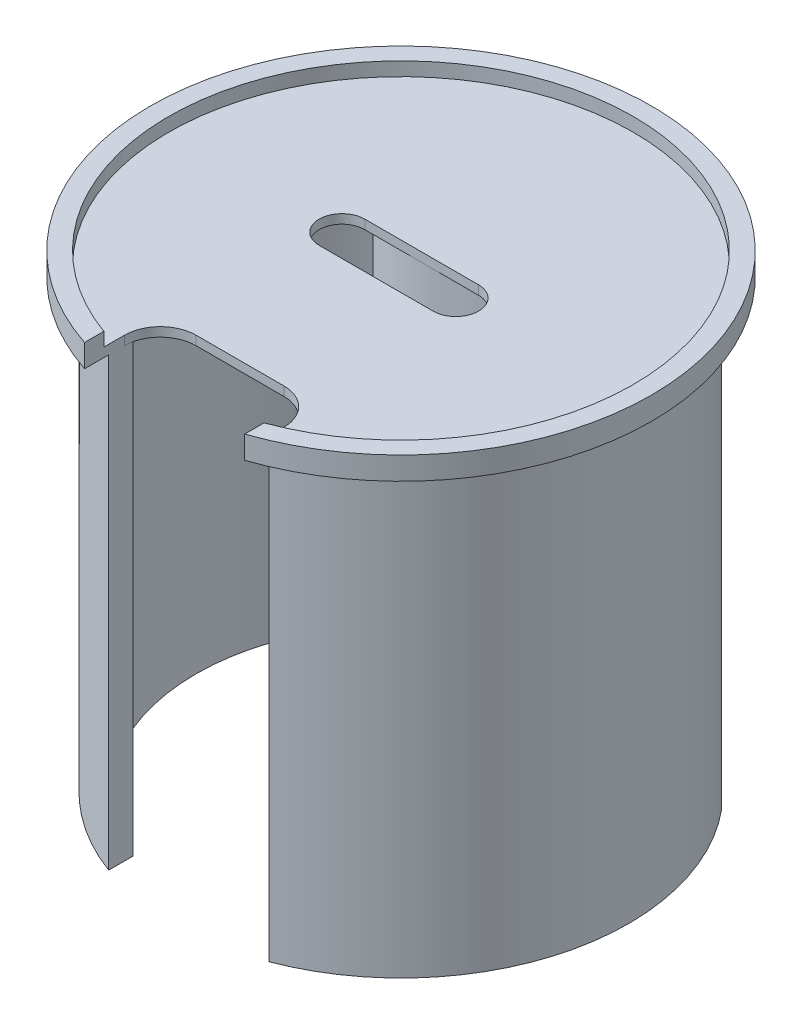
ISO-10303-21;
HEADER;
FILE_DESCRIPTION(('STEP AP214'),'2;1');
FILE_NAME('part.step','',(''),(''),'','','');
FILE_SCHEMA(('AUTOMOTIVE_DESIGN { 1 0 10303 214 1 1 1 1 }'));
ENDSEC;
DATA;
#1=APPLICATION_CONTEXT('core data for automotive mechanical design processes');
#2=APPLICATION_PROTOCOL_DEFINITION('international standard','automotive_design',2000,#1);
#3=PRODUCT_CONTEXT('',#1,'mechanical');
#4=PRODUCT('Part','Part','',(#3));
#5=PRODUCT_RELATED_PRODUCT_CATEGORY('part','',(#4));
#6=PRODUCT_DEFINITION_FORMATION('','',#4);
#7=PRODUCT_DEFINITION_CONTEXT('part definition',#1,'design');
#8=PRODUCT_DEFINITION('design','',#6,#7);
#9=PRODUCT_DEFINITION_SHAPE('','',#8);
#10=(LENGTH_UNIT() NAMED_UNIT(*) SI_UNIT(.MILLI.,.METRE.));
#11=(NAMED_UNIT(*) PLANE_ANGLE_UNIT() SI_UNIT($,.RADIAN.));
#12=(NAMED_UNIT(*) SI_UNIT($,.STERADIAN.) SOLID_ANGLE_UNIT());
#13=UNCERTAINTY_MEASURE_WITH_UNIT(LENGTH_MEASURE(1.E-05),#10,'distance_accuracy_value','');
#14=(GEOMETRIC_REPRESENTATION_CONTEXT(3) GLOBAL_UNCERTAINTY_ASSIGNED_CONTEXT((#13)) GLOBAL_UNIT_ASSIGNED_CONTEXT((#10,
#11,#12)) REPRESENTATION_CONTEXT('',''));
#15=CARTESIAN_POINT('',(0.,0.,0.));
#16=DIRECTION('',(0.,0.,1.));
#17=DIRECTION('',(1.,0.,0.));
#18=AXIS2_PLACEMENT_3D('',#15,#16,#17);
#19=CARTESIAN_POINT('',(0.,0.,0.));
#20=DIRECTION('',(0.,1.,0.));
#21=DIRECTION('',(0.,0.,1.));
#22=AXIS2_PLACEMENT_3D('',#19,#20,#21);
#23=PLANE('',#22);
#24=CARTESIAN_POINT('',(-16.4484896272888,0.,0.));
#25=DIRECTION('',(0.,1.,0.));
#26=DIRECTION('',(0.,0.,1.));
#27=AXIS2_PLACEMENT_3D('',#24,#25,#26);
#28=CIRCLE('',#27,6.35);
#29=CARTESIAN_POINT('',(-16.4484896272888,0.,-6.35));
#30=VERTEX_POINT('',#29);
#31=CARTESIAN_POINT('',(-16.4484896272888,0.,6.35));
#32=VERTEX_POINT('',#31);
#33=EDGE_CURVE('E389',#30,#32,#28,.T.);
#34=ORIENTED_EDGE('',*,*,#33,.T.);
#35=DIRECTION('',(1.,0.,0.));
#36=VECTOR('',#35,1.);
#37=CARTESIAN_POINT('',(-16.4484896272888,0.,6.35));
#38=LINE('',#37,#36);
#39=CARTESIAN_POINT('',(15.3015103727112,0.,6.35));
#40=VERTEX_POINT('',#39);
#41=EDGE_CURVE('E393',#32,#40,#38,.T.);
#42=ORIENTED_EDGE('',*,*,#41,.T.);
#43=CARTESIAN_POINT('',(15.3015103727112,0.,0.));
#44=DIRECTION('',(0.,1.,0.));
#45=DIRECTION('',(0.,0.,1.));
#46=AXIS2_PLACEMENT_3D('',#43,#44,#45);
#47=CIRCLE('',#46,6.35);
#48=CARTESIAN_POINT('',(15.3015103727112,0.,-6.35));
#49=VERTEX_POINT('',#48);
#50=EDGE_CURVE('E397',#40,#49,#47,.T.);
#51=ORIENTED_EDGE('',*,*,#50,.T.);
#52=DIRECTION('',(-1.,0.,0.));
#53=VECTOR('',#52,1.);
#54=CARTESIAN_POINT('',(-16.4484896272888,0.,-6.35));
#55=LINE('',#54,#53);
#56=EDGE_CURVE('E401',#49,#30,#55,.T.);
#57=ORIENTED_EDGE('',*,*,#56,.T.);
#58=EDGE_LOOP('',(#34,#42,#51,#57));
#59=FACE_BOUND('',#58,.T.);
#60=CARTESIAN_POINT('',(0.,0.,0.));
#61=DIRECTION('',(0.,1.,0.));
#62=DIRECTION('',(0.,0.,1.));
#63=AXIS2_PLACEMENT_3D('',#60,#61,#62);
#64=CIRCLE('',#63,57.15);
#65=CARTESIAN_POINT('',(22.5371652830511,0.,52.5185555875677));
#66=VERTEX_POINT('',#65);
#67=CARTESIAN_POINT('',(40.1810017296732,0.,-40.64));
#68=VERTEX_POINT('',#67);
#69=EDGE_CURVE('E247',#66,#68,#64,.T.);
#70=ORIENTED_EDGE('',*,*,#69,.F.);
#71=DIRECTION('',(0.,0.,1.));
#72=VECTOR('',#71,1.);
#73=CARTESIAN_POINT('',(22.5371652830511,0.,0.));
#74=LINE('',#73,#72);
#75=CARTESIAN_POINT('',(22.5371652830511,0.,55.2053311286864));
#76=VERTEX_POINT('',#75);
#77=EDGE_CURVE('E233',#66,#76,#74,.T.);
#78=ORIENTED_EDGE('',*,*,#77,.T.);
#79=CARTESIAN_POINT('',(12.5371652830511,0.,55.2053311286864));
#80=DIRECTION('',(0.,1.,0.));
#81=DIRECTION('',(0.,0.,1.));
#82=AXIS2_PLACEMENT_3D('',#79,#80,#81);
#83=CIRCLE('',#82,10.);
#84=CARTESIAN_POINT('',(12.5371652830511,0.,45.2053311286864));
#85=VERTEX_POINT('',#84);
#86=EDGE_CURVE('E458',#76,#85,#83,.T.);
#87=ORIENTED_EDGE('',*,*,#86,.T.);
#88=DIRECTION('',(-1.,0.,0.));
#89=VECTOR('',#88,1.);
#90=CARTESIAN_POINT('',(22.5371652830511,0.,45.2053311286864));
#91=LINE('',#90,#89);
#92=CARTESIAN_POINT('',(-11.9128347169489,0.,45.2053311286864));
#93=VERTEX_POINT('',#92);
#94=EDGE_CURVE('E341',#85,#93,#91,.T.);
#95=ORIENTED_EDGE('',*,*,#94,.T.);
#96=CARTESIAN_POINT('',(-11.9128347169489,0.,55.2053311286864));
#97=DIRECTION('',(0.,1.,0.));
#98=DIRECTION('',(0.,0.,1.));
#99=AXIS2_PLACEMENT_3D('',#96,#97,#98);
#100=CIRCLE('',#99,10.);
#101=CARTESIAN_POINT('',(-21.9128347169489,0.,55.2053311286864));
#102=VERTEX_POINT('',#101);
#103=EDGE_CURVE('E11',#93,#102,#100,.T.);
#104=ORIENTED_EDGE('',*,*,#103,.T.);
#105=DIRECTION('',(0.,0.,-1.));
#106=VECTOR('',#105,1.);
#107=CARTESIAN_POINT('',(-21.912834716949,0.,0.));
#108=LINE('',#107,#106);
#109=CARTESIAN_POINT('',(-21.9128347169489,0.,52.7821008928943));
#110=VERTEX_POINT('',#109);
#111=EDGE_CURVE('E269',#102,#110,#108,.T.);
#112=ORIENTED_EDGE('',*,*,#111,.T.);
#113=CARTESIAN_POINT('',(0.,0.,0.));
#114=DIRECTION('',(0.,1.,0.));
#115=DIRECTION('',(0.,0.,1.));
#116=AXIS2_PLACEMENT_3D('',#113,#114,#115);
#117=CIRCLE('',#116,57.15);
#118=CARTESIAN_POINT('',(-40.1810017296732,0.,-40.64));
#119=VERTEX_POINT('',#118);
#120=EDGE_CURVE('E285',#119,#110,#117,.T.);
#121=ORIENTED_EDGE('',*,*,#120,.F.);
#122=DIRECTION('',(-1.,0.,0.));
#123=VECTOR('',#122,1.);
#124=CARTESIAN_POINT('',(0.,0.,-40.64));
#125=LINE('',#124,#123);
#126=CARTESIAN_POINT('',(-48.7918066892383,0.,-40.64));
#127=VERTEX_POINT('',#126);
#128=EDGE_CURVE('E288',#119,#127,#125,.T.);
#129=ORIENTED_EDGE('',*,*,#128,.T.);
#130=CARTESIAN_POINT('',(0.,0.,0.));
#131=DIRECTION('',(0.,1.,0.));
#132=DIRECTION('',(0.,0.,1.));
#133=AXIS2_PLACEMENT_3D('',#130,#131,#132);
#134=CIRCLE('',#133,63.5);
#135=CARTESIAN_POINT('',(-21.9128347169489,0.,59.5993093472372));
#136=VERTEX_POINT('',#135);
#137=EDGE_CURVE('E282',#127,#136,#134,.T.);
#138=ORIENTED_EDGE('',*,*,#137,.T.);
#139=DIRECTION('',(0.,0.,1.));
#140=VECTOR('',#139,1.);
#141=CARTESIAN_POINT('',(-21.9128347169489,0.,45.2053311286864));
#142=LINE('',#141,#140);
#143=CARTESIAN_POINT('',(-21.9128347169489,0.,66.3238281062521));
#144=VERTEX_POINT('',#143);
#145=EDGE_CURVE('E346',#136,#144,#142,.T.);
#146=ORIENTED_EDGE('',*,*,#145,.T.);
#147=CARTESIAN_POINT('',(0.,0.,0.));
#148=DIRECTION('',(0.,1.,0.));
#149=DIRECTION('',(0.,0.,1.));
#150=AXIS2_PLACEMENT_3D('',#147,#148,#149);
#151=CIRCLE('',#150,69.85);
#152=CARTESIAN_POINT('',(22.5371652830511,0.,66.1142849995705));
#153=VERTEX_POINT('',#152);
#154=EDGE_CURVE('E417',#153,#144,#151,.T.);
#155=ORIENTED_EDGE('',*,*,#154,.F.);
#156=DIRECTION('',(0.,0.,-1.));
#157=VECTOR('',#156,1.);
#158=CARTESIAN_POINT('',(22.5371652830511,0.,45.2053311286864));
#159=LINE('',#158,#157);
#160=CARTESIAN_POINT('',(22.5371652830511,0.,59.3660355843679));
#161=VERTEX_POINT('',#160);
#162=EDGE_CURVE('E338',#153,#161,#159,.T.);
#163=ORIENTED_EDGE('',*,*,#162,.T.);
#164=CARTESIAN_POINT('',(0.,0.,0.));
#165=DIRECTION('',(0.,1.,0.));
#166=DIRECTION('',(0.,0.,1.));
#167=AXIS2_PLACEMENT_3D('',#164,#165,#166);
#168=CIRCLE('',#167,63.5);
#169=CARTESIAN_POINT('',(48.7918066892383,0.,-40.64));
#170=VERTEX_POINT('',#169);
#171=EDGE_CURVE('E205',#161,#170,#168,.T.);
#172=ORIENTED_EDGE('',*,*,#171,.T.);
#173=DIRECTION('',(1.,0.,0.));
#174=VECTOR('',#173,1.);
#175=CARTESIAN_POINT('',(0.,0.,-40.64));
#176=LINE('',#175,#174);
#177=EDGE_CURVE('E244',#68,#170,#176,.T.);
#178=ORIENTED_EDGE('',*,*,#177,.F.);
#179=EDGE_LOOP('',(#70,#78,#87,#95,#104,#112,#121,#129,#138,#146,#155,#163,#172,#178));
#180=FACE_BOUND('',#179,.T.);
#181=CARTESIAN_POINT('',(0.,0.,-40.64));
#182=DIRECTION('',(0.,-1.,0.));
#183=DIRECTION('',(0.,0.,-1.));
#184=AXIS2_PLACEMENT_3D('',#181,#182,#183);
#185=CIRCLE('',#184,34.2582068835355);
#186=CARTESIAN_POINT('',(34.2582068835355,0.,-40.64));
#187=VERTEX_POINT('',#186);
#188=CARTESIAN_POINT('',(-34.2582068835355,0.,-40.64));
#189=VERTEX_POINT('',#188);
#190=EDGE_CURVE('E292',#187,#189,#185,.T.);
#191=ORIENTED_EDGE('',*,*,#190,.F.);
#192=DIRECTION('',(1.,0.,0.));
#193=VECTOR('',#192,1.);
#194=CARTESIAN_POINT('',(34.2582068835355,0.,-40.64));
#195=LINE('',#194,#193);
#196=CARTESIAN_POINT('',(30.4482068835355,0.,-40.64));
#197=VERTEX_POINT('',#196);
#198=EDGE_CURVE('E298',#197,#187,#195,.T.);
#199=ORIENTED_EDGE('',*,*,#198,.F.);
#200=CARTESIAN_POINT('',(0.,0.,-40.64));
#201=DIRECTION('',(0.,1.,0.));
#202=DIRECTION('',(0.,0.,-1.));
#203=AXIS2_PLACEMENT_3D('',#200,#201,#202);
#204=CIRCLE('',#203,30.4482068835355);
#205=CARTESIAN_POINT('',(-30.4482068835355,0.,-40.64));
#206=VERTEX_POINT('',#205);
#207=EDGE_CURVE('E315',#206,#197,#204,.T.);
#208=ORIENTED_EDGE('',*,*,#207,.F.);
#209=DIRECTION('',(1.,0.,0.));
#210=VECTOR('',#209,1.);
#211=CARTESIAN_POINT('',(-30.4482068835355,0.,-40.64));
#212=LINE('',#211,#210);
#213=EDGE_CURVE('E311',#189,#206,#212,.T.);
#214=ORIENTED_EDGE('',*,*,#213,.F.);
#215=EDGE_LOOP('',(#191,#199,#208,#214));
#216=FACE_BOUND('',#215,.T.);
#217=ADVANCED_FACE('F39',(#59,#180,#216),#23,.F.);
#218=CARTESIAN_POINT('',(-16.4484896272888,6.35,0.));
#219=DIRECTION('',(0.,-1.,0.));
#220=DIRECTION('',(0.,0.,-1.));
#221=AXIS2_PLACEMENT_3D('',#218,#219,#220);
#222=CYLINDRICAL_SURFACE('',#221,6.35);
#223=DIRECTION('',(0.,-1.,0.));
#224=VECTOR('',#223,1.);
#225=CARTESIAN_POINT('',(-16.4484896272888,6.35,-6.35));
#226=LINE('',#225,#224);
#227=CARTESIAN_POINT('',(-16.4484896272888,2.54,-6.35));
#228=VERTEX_POINT('',#227);
#229=EDGE_CURVE('E405',#228,#30,#226,.T.);
#230=ORIENTED_EDGE('',*,*,#229,.F.);
#231=CARTESIAN_POINT('',(-16.4484896272888,2.54,0.));
#232=DIRECTION('',(0.,1.,0.));
#233=DIRECTION('',(0.,0.,1.));
#234=AXIS2_PLACEMENT_3D('',#231,#232,#233);
#235=CIRCLE('',#234,6.35);
#236=CARTESIAN_POINT('',(-16.4484896272888,2.54,6.35));
#237=VERTEX_POINT('',#236);
#238=EDGE_CURVE('E385',#228,#237,#235,.T.);
#239=ORIENTED_EDGE('',*,*,#238,.T.);
#240=DIRECTION('',(0.,-1.,0.));
#241=VECTOR('',#240,1.);
#242=CARTESIAN_POINT('',(-16.4484896272888,6.35,6.35));
#243=LINE('',#242,#241);
#244=EDGE_CURVE('E414',#237,#32,#243,.T.);
#245=ORIENTED_EDGE('',*,*,#244,.T.);
#246=ORIENTED_EDGE('',*,*,#33,.F.);
#247=EDGE_LOOP('',(#230,#239,#245,#246));
#248=FACE_BOUND('',#247,.T.);
#249=ADVANCED_FACE('F522',(#248),#222,.F.);
#250=CARTESIAN_POINT('',(-16.4484896272888,6.35,6.35));
#251=DIRECTION('',(0.,0.,-1.));
#252=DIRECTION('',(-1.,0.,0.));
#253=AXIS2_PLACEMENT_3D('',#250,#251,#252);
#254=PLANE('',#253);
#255=ORIENTED_EDGE('',*,*,#244,.F.);
#256=DIRECTION('',(1.,0.,0.));
#257=VECTOR('',#256,1.);
#258=CARTESIAN_POINT('',(-16.4484896272888,2.54,6.35));
#259=LINE('',#258,#257);
#260=CARTESIAN_POINT('',(15.3015103727112,2.54,6.35));
#261=VERTEX_POINT('',#260);
#262=EDGE_CURVE('E381',#237,#261,#259,.T.);
#263=ORIENTED_EDGE('',*,*,#262,.T.);
#264=DIRECTION('',(0.,-1.,0.));
#265=VECTOR('',#264,1.);
#266=CARTESIAN_POINT('',(15.3015103727112,6.35,6.35));
#267=LINE('',#266,#265);
#268=EDGE_CURVE('E411',#261,#40,#267,.T.);
#269=ORIENTED_EDGE('',*,*,#268,.T.);
#270=ORIENTED_EDGE('',*,*,#41,.F.);
#271=EDGE_LOOP('',(#255,#263,#269,#270));
#272=FACE_BOUND('',#271,.T.);
#273=ADVANCED_FACE('F528',(#272),#254,.T.);
#274=CARTESIAN_POINT('',(15.3015103727112,6.35,0.));
#275=DIRECTION('',(0.,-1.,0.));
#276=DIRECTION('',(0.,0.,-1.));
#277=AXIS2_PLACEMENT_3D('',#274,#275,#276);
#278=CYLINDRICAL_SURFACE('',#277,6.35);
#279=ORIENTED_EDGE('',*,*,#268,.F.);
#280=CARTESIAN_POINT('',(15.3015103727112,2.54,0.));
#281=DIRECTION('',(0.,1.,0.));
#282=DIRECTION('',(0.,0.,1.));
#283=AXIS2_PLACEMENT_3D('',#280,#281,#282);
#284=CIRCLE('',#283,6.35);
#285=CARTESIAN_POINT('',(15.3015103727112,2.54,-6.35));
#286=VERTEX_POINT('',#285);
#287=EDGE_CURVE('E374',#261,#286,#284,.T.);
#288=ORIENTED_EDGE('',*,*,#287,.T.);
#289=DIRECTION('',(0.,-1.,0.));
#290=VECTOR('',#289,1.);
#291=CARTESIAN_POINT('',(15.3015103727112,6.35,-6.35));
#292=LINE('',#291,#290);
#293=EDGE_CURVE('E408',#286,#49,#292,.T.);
#294=ORIENTED_EDGE('',*,*,#293,.T.);
#295=ORIENTED_EDGE('',*,*,#50,.F.);
#296=EDGE_LOOP('',(#279,#288,#294,#295));
#297=FACE_BOUND('',#296,.T.);
#298=ADVANCED_FACE('F556',(#297),#278,.F.);
#299=CARTESIAN_POINT('',(-16.4484896272888,6.35,-6.35));
#300=DIRECTION('',(0.,0.,1.));
#301=DIRECTION('',(1.,0.,0.));
#302=AXIS2_PLACEMENT_3D('',#299,#300,#301);
#303=PLANE('',#302);
#304=ORIENTED_EDGE('',*,*,#293,.F.);
#305=DIRECTION('',(-1.,0.,0.));
#306=VECTOR('',#305,1.);
#307=CARTESIAN_POINT('',(-16.4484896272888,2.54,-6.35));
#308=LINE('',#307,#306);
#309=EDGE_CURVE('E422',#286,#228,#308,.T.);
#310=ORIENTED_EDGE('',*,*,#309,.T.);
#311=ORIENTED_EDGE('',*,*,#229,.T.);
#312=ORIENTED_EDGE('',*,*,#56,.F.);
#313=EDGE_LOOP('',(#304,#310,#311,#312));
#314=FACE_BOUND('',#313,.T.);
#315=ADVANCED_FACE('F553',(#314),#303,.T.);
#316=CARTESIAN_POINT('',(0.,6.35,0.));
#317=DIRECTION('',(0.,1.,0.));
#318=DIRECTION('',(0.,0.,1.));
#319=AXIS2_PLACEMENT_3D('',#316,#317,#318);
#320=PLANE('',#319);
#321=DIRECTION('',(0.,0.,-1.));
#322=VECTOR('',#321,1.);
#323=CARTESIAN_POINT('',(22.5371652830511,6.35,45.2053311286864));
#324=LINE('',#323,#322);
#325=CARTESIAN_POINT('',(22.5371652830511,6.35,66.1142849995705));
#326=VERTEX_POINT('',#325);
#327=CARTESIAN_POINT('',(22.5371652830511,6.35,60.7225582547741));
#328=VERTEX_POINT('',#327);
#329=EDGE_CURVE('E337',#326,#328,#324,.T.);
#330=ORIENTED_EDGE('',*,*,#329,.F.);
#331=CARTESIAN_POINT('',(0.,6.35,0.));
#332=DIRECTION('',(0.,1.,0.));
#333=DIRECTION('',(0.,0.,1.));
#334=AXIS2_PLACEMENT_3D('',#331,#332,#333);
#335=CIRCLE('',#334,69.85);
#336=CARTESIAN_POINT('',(-21.9128347169489,6.35,66.3238281062521));
#337=VERTEX_POINT('',#336);
#338=EDGE_CURVE('E418',#326,#337,#335,.T.);
#339=ORIENTED_EDGE('',*,*,#338,.T.);
#340=DIRECTION('',(0.,0.,1.));
#341=VECTOR('',#340,1.);
#342=CARTESIAN_POINT('',(-21.9128347169489,6.35,45.2053311286864));
#343=LINE('',#342,#341);
#344=CARTESIAN_POINT('',(-21.9128347169489,6.35,60.9506404779119));
#345=VERTEX_POINT('',#344);
#346=EDGE_CURVE('E342',#345,#337,#343,.T.);
#347=ORIENTED_EDGE('',*,*,#346,.F.);
#348=CARTESIAN_POINT('',(0.,6.35,0.));
#349=DIRECTION('',(0.,1.,0.));
#350=DIRECTION('',(0.,0.,1.));
#351=AXIS2_PLACEMENT_3D('',#348,#349,#350);
#352=CIRCLE('',#351,64.77);
#353=EDGE_CURVE('E369',#328,#345,#352,.T.);
#354=ORIENTED_EDGE('',*,*,#353,.F.);
#355=EDGE_LOOP('',(#330,#339,#347,#354));
#356=FACE_BOUND('',#355,.T.);
#357=ADVANCED_FACE('F494',(#356),#320,.T.);
#358=CARTESIAN_POINT('',(0.,6.35,0.));
#359=DIRECTION('',(0.,-1.,0.));
#360=DIRECTION('',(0.,0.,-1.));
#361=AXIS2_PLACEMENT_3D('',#358,#359,#360);
#362=CYLINDRICAL_SURFACE('',#361,69.85);
#363=ORIENTED_EDGE('',*,*,#338,.F.);
#364=DIRECTION('',(0.,-1.,0.));
#365=VECTOR('',#364,1.);
#366=CARTESIAN_POINT('',(22.5371652830511,6.35,66.1142849995705));
#367=LINE('',#366,#365);
#368=EDGE_CURVE('E365',#326,#153,#367,.T.);
#369=ORIENTED_EDGE('',*,*,#368,.T.);
#370=ORIENTED_EDGE('',*,*,#154,.T.);
#371=DIRECTION('',(0.,-1.,0.));
#372=VECTOR('',#371,1.);
#373=CARTESIAN_POINT('',(-21.9128347169489,6.35,66.3238281062521));
#374=LINE('',#373,#372);
#375=EDGE_CURVE('E357',#144,#337,#374,.F.);
#376=ORIENTED_EDGE('',*,*,#375,.T.);
#377=EDGE_LOOP('',(#363,#369,#370,#376));
#378=FACE_BOUND('',#377,.T.);
#379=ADVANCED_FACE('F497',(#378),#362,.T.);
#380=CARTESIAN_POINT('',(0.,2.54,0.));
#381=DIRECTION('',(0.,1.,0.));
#382=DIRECTION('',(0.,0.,1.));
#383=AXIS2_PLACEMENT_3D('',#380,#381,#382);
#384=CYLINDRICAL_SURFACE('',#383,64.77);
#385=CARTESIAN_POINT('',(0.,2.54,0.));
#386=DIRECTION('',(0.,1.,0.));
#387=DIRECTION('',(0.,0.,1.));
#388=AXIS2_PLACEMENT_3D('',#385,#386,#387);
#389=CIRCLE('',#388,64.77);
#390=CARTESIAN_POINT('',(22.5371652830511,2.54,60.7225582547741));
#391=VERTEX_POINT('',#390);
#392=CARTESIAN_POINT('',(-21.9128347169489,2.54,60.9506404779119));
#393=VERTEX_POINT('',#392);
#394=EDGE_CURVE('E370',#391,#393,#389,.T.);
#395=ORIENTED_EDGE('',*,*,#394,.F.);
#396=DIRECTION('',(0.,1.,0.));
#397=VECTOR('',#396,1.);
#398=CARTESIAN_POINT('',(22.5371652830511,2.54,60.7225582547741));
#399=LINE('',#398,#397);
#400=EDGE_CURVE('E361',#391,#328,#399,.T.);
#401=ORIENTED_EDGE('',*,*,#400,.T.);
#402=ORIENTED_EDGE('',*,*,#353,.T.);
#403=DIRECTION('',(0.,1.,0.));
#404=VECTOR('',#403,1.);
#405=CARTESIAN_POINT('',(-21.9128347169489,2.54,60.9506404779119));
#406=LINE('',#405,#404);
#407=EDGE_CURVE('E349',#345,#393,#406,.F.);
#408=ORIENTED_EDGE('',*,*,#407,.T.);
#409=EDGE_LOOP('',(#395,#401,#402,#408));
#410=FACE_BOUND('',#409,.T.);
#411=ADVANCED_FACE('F485',(#410),#384,.F.);
#412=CARTESIAN_POINT('',(0.,2.54,0.));
#413=DIRECTION('',(0.,1.,0.));
#414=DIRECTION('',(0.,0.,1.));
#415=AXIS2_PLACEMENT_3D('',#412,#413,#414);
#416=PLANE('',#415);
#417=CARTESIAN_POINT('',(12.5371652830511,2.54,55.2053311286864));
#418=DIRECTION('',(0.,1.,0.));
#419=DIRECTION('',(0.,0.,1.));
#420=AXIS2_PLACEMENT_3D('',#417,#418,#419);
#421=CIRCLE('',#420,10.);
#422=CARTESIAN_POINT('',(12.5371652830511,2.54,45.2053311286864));
#423=VERTEX_POINT('',#422);
#424=CARTESIAN_POINT('',(22.5371652830511,2.54,55.2053311286864));
#425=VERTEX_POINT('',#424);
#426=EDGE_CURVE('E454',#423,#425,#421,.F.);
#427=ORIENTED_EDGE('',*,*,#426,.T.);
#428=DIRECTION('',(0.,0.,-1.));
#429=VECTOR('',#428,1.);
#430=CARTESIAN_POINT('',(22.5371652830511,2.54,0.));
#431=LINE('',#430,#429);
#432=EDGE_CURVE('E436',#391,#425,#431,.T.);
#433=ORIENTED_EDGE('',*,*,#432,.F.);
#434=ORIENTED_EDGE('',*,*,#394,.T.);
#435=DIRECTION('',(0.,0.,1.));
#436=VECTOR('',#435,1.);
#437=CARTESIAN_POINT('',(-21.912834716949,2.54,0.));
#438=LINE('',#437,#436);
#439=CARTESIAN_POINT('',(-21.9128347169489,2.54,55.2053311286864));
#440=VERTEX_POINT('',#439);
#441=EDGE_CURVE('E433',#440,#393,#438,.T.);
#442=ORIENTED_EDGE('',*,*,#441,.F.);
#443=CARTESIAN_POINT('',(-11.9128347169489,2.54,55.2053311286864));
#444=DIRECTION('',(0.,1.,0.));
#445=DIRECTION('',(0.,0.,1.));
#446=AXIS2_PLACEMENT_3D('',#443,#444,#445);
#447=CIRCLE('',#446,10.);
#448=CARTESIAN_POINT('',(-11.9128347169489,2.54,45.2053311286864));
#449=VERTEX_POINT('',#448);
#450=EDGE_CURVE('E48',#440,#449,#447,.F.);
#451=ORIENTED_EDGE('',*,*,#450,.T.);
#452=DIRECTION('',(-1.,0.,0.));
#453=VECTOR('',#452,1.);
#454=CARTESIAN_POINT('',(0.,2.54,45.2053311286864));
#455=LINE('',#454,#453);
#456=EDGE_CURVE('E429',#423,#449,#455,.T.);
#457=ORIENTED_EDGE('',*,*,#456,.F.);
#458=EDGE_LOOP('',(#427,#433,#434,#442,#451,#457));
#459=FACE_BOUND('',#458,.T.);
#460=ORIENTED_EDGE('',*,*,#309,.F.);
#461=ORIENTED_EDGE('',*,*,#287,.F.);
#462=ORIENTED_EDGE('',*,*,#262,.F.);
#463=ORIENTED_EDGE('',*,*,#238,.F.);
#464=EDGE_LOOP('',(#460,#461,#462,#463));
#465=FACE_BOUND('',#464,.T.);
#466=ADVANCED_FACE('F464',(#459,#465),#416,.T.);
#467=CARTESIAN_POINT('',(22.5371652830511,0.,45.2053311286864));
#468=DIRECTION('',(1.,0.,0.));
#469=DIRECTION('',(0.,0.,-1.));
#470=AXIS2_PLACEMENT_3D('',#467,#468,#469);
#471=PLANE('',#470);
#472=ORIENTED_EDGE('',*,*,#432,.T.);
#473=DIRECTION('',(0.,1.,0.));
#474=VECTOR('',#473,1.);
#475=CARTESIAN_POINT('',(22.5371652830511,0.,55.2053311286864));
#476=LINE('',#475,#474);
#477=EDGE_CURVE('E446',#425,#76,#476,.F.);
#478=ORIENTED_EDGE('',*,*,#477,.T.);
#479=ORIENTED_EDGE('',*,*,#77,.F.);
#480=DIRECTION('',(0.,1.,0.));
#481=VECTOR('',#480,1.);
#482=CARTESIAN_POINT('',(22.5371652830511,-124.46,52.5185555875677));
#483=LINE('',#482,#481);
#484=CARTESIAN_POINT('',(22.5371652830511,-124.46,52.5185555875677));
#485=VERTEX_POINT('',#484);
#486=EDGE_CURVE('E222',#485,#66,#483,.T.);
#487=ORIENTED_EDGE('',*,*,#486,.F.);
#488=DIRECTION('',(0.,0.,1.));
#489=VECTOR('',#488,1.);
#490=CARTESIAN_POINT('',(22.5371652830511,-124.46,0.));
#491=LINE('',#490,#489);
#492=CARTESIAN_POINT('',(22.5371652830511,-124.46,59.3660355843679));
#493=VERTEX_POINT('',#492);
#494=EDGE_CURVE('E215',#485,#493,#491,.T.);
#495=ORIENTED_EDGE('',*,*,#494,.T.);
#496=DIRECTION('',(0.,1.,0.));
#497=VECTOR('',#496,1.);
#498=CARTESIAN_POINT('',(22.5371652830511,-124.46,59.3660355843679));
#499=LINE('',#498,#497);
#500=EDGE_CURVE('E200',#493,#161,#499,.T.);
#501=ORIENTED_EDGE('',*,*,#500,.T.);
#502=ORIENTED_EDGE('',*,*,#162,.F.);
#503=ORIENTED_EDGE('',*,*,#368,.F.);
#504=ORIENTED_EDGE('',*,*,#329,.T.);
#505=ORIENTED_EDGE('',*,*,#400,.F.);
#506=EDGE_LOOP('',(#472,#478,#479,#487,#495,#501,#502,#503,#504,#505));
#507=FACE_BOUND('',#506,.T.);
#508=ADVANCED_FACE('F220',(#507),#471,.F.);
#509=CARTESIAN_POINT('',(-21.9128347169489,0.,45.2053311286864));
#510=DIRECTION('',(-1.,0.,0.));
#511=DIRECTION('',(0.,0.,1.));
#512=AXIS2_PLACEMENT_3D('',#509,#510,#511);
#513=PLANE('',#512);
#514=ORIENTED_EDGE('',*,*,#145,.F.);
#515=DIRECTION('',(0.,1.,0.));
#516=VECTOR('',#515,1.);
#517=CARTESIAN_POINT('',(-21.9128347169489,-124.46,59.5993093472372));
#518=LINE('',#517,#516);
#519=CARTESIAN_POINT('',(-21.9128347169489,-124.46,59.5993093472372));
#520=VERTEX_POINT('',#519);
#521=EDGE_CURVE('E63',#520,#136,#518,.T.);
#522=ORIENTED_EDGE('',*,*,#521,.F.);
#523=DIRECTION('',(0.,0.,-1.));
#524=VECTOR('',#523,1.);
#525=CARTESIAN_POINT('',(-21.912834716949,-124.46,0.));
#526=LINE('',#525,#524);
#527=CARTESIAN_POINT('',(-21.9128347169489,-124.46,52.7821008928943));
#528=VERTEX_POINT('',#527);
#529=EDGE_CURVE('E257',#520,#528,#526,.T.);
#530=ORIENTED_EDGE('',*,*,#529,.T.);
#531=DIRECTION('',(0.,1.,0.));
#532=VECTOR('',#531,1.);
#533=CARTESIAN_POINT('',(-21.9128347169489,-124.46,52.7821008928943));
#534=LINE('',#533,#532);
#535=EDGE_CURVE('E270',#528,#110,#534,.T.);
#536=ORIENTED_EDGE('',*,*,#535,.T.);
#537=ORIENTED_EDGE('',*,*,#111,.F.);
#538=DIRECTION('',(0.,1.,0.));
#539=VECTOR('',#538,1.);
#540=CARTESIAN_POINT('',(-21.9128347169489,2.54,55.2053311286864));
#541=LINE('',#540,#539);
#542=EDGE_CURVE('E450',#102,#440,#541,.T.);
#543=ORIENTED_EDGE('',*,*,#542,.T.);
#544=ORIENTED_EDGE('',*,*,#441,.T.);
#545=ORIENTED_EDGE('',*,*,#407,.F.);
#546=ORIENTED_EDGE('',*,*,#346,.T.);
#547=ORIENTED_EDGE('',*,*,#375,.F.);
#548=EDGE_LOOP('',(#514,#522,#530,#536,#537,#543,#544,#545,#546,#547));
#549=FACE_BOUND('',#548,.T.);
#550=ADVANCED_FACE('F490',(#549),#513,.F.);
#551=CARTESIAN_POINT('',(22.5371652830511,0.,45.2053311286864));
#552=DIRECTION('',(0.,0.,-1.));
#553=DIRECTION('',(-1.,0.,0.));
#554=AXIS2_PLACEMENT_3D('',#551,#552,#553);
#555=PLANE('',#554);
#556=ORIENTED_EDGE('',*,*,#94,.F.);
#557=DIRECTION('',(0.,1.,0.));
#558=VECTOR('',#557,1.);
#559=CARTESIAN_POINT('',(12.5371652830511,2.54,45.2053311286864));
#560=LINE('',#559,#558);
#561=EDGE_CURVE('E442',#85,#423,#560,.T.);
#562=ORIENTED_EDGE('',*,*,#561,.T.);
#563=ORIENTED_EDGE('',*,*,#456,.T.);
#564=DIRECTION('',(0.,1.,0.));
#565=VECTOR('',#564,1.);
#566=CARTESIAN_POINT('',(-11.9128347169489,0.,45.2053311286864));
#567=LINE('',#566,#565);
#568=EDGE_CURVE('E439',#449,#93,#567,.F.);
#569=ORIENTED_EDGE('',*,*,#568,.T.);
#570=EDGE_LOOP('',(#556,#562,#563,#569));
#571=FACE_BOUND('',#570,.T.);
#572=ADVANCED_FACE('F471',(#571),#555,.F.);
#573=CARTESIAN_POINT('',(12.5371652830511,0.,55.2053311286864));
#574=DIRECTION('',(0.,-1.,0.));
#575=DIRECTION('',(0.,0.,-1.));
#576=AXIS2_PLACEMENT_3D('',#573,#574,#575);
#577=CYLINDRICAL_SURFACE('',#576,10.);
#578=ORIENTED_EDGE('',*,*,#86,.F.);
#579=ORIENTED_EDGE('',*,*,#477,.F.);
#580=ORIENTED_EDGE('',*,*,#426,.F.);
#581=ORIENTED_EDGE('',*,*,#561,.F.);
#582=EDGE_LOOP('',(#578,#579,#580,#581));
#583=FACE_BOUND('',#582,.T.);
#584=ADVANCED_FACE('F480',(#583),#577,.F.);
#585=CARTESIAN_POINT('',(-11.9128347169489,0.,55.2053311286864));
#586=DIRECTION('',(0.,-1.,0.));
#587=DIRECTION('',(0.,0.,-1.));
#588=AXIS2_PLACEMENT_3D('',#585,#586,#587);
#589=CYLINDRICAL_SURFACE('',#588,10.);
#590=ORIENTED_EDGE('',*,*,#103,.F.);
#591=ORIENTED_EDGE('',*,*,#568,.F.);
#592=ORIENTED_EDGE('',*,*,#450,.F.);
#593=ORIENTED_EDGE('',*,*,#542,.F.);
#594=EDGE_LOOP('',(#590,#591,#592,#593));
#595=FACE_BOUND('',#594,.T.);
#596=ADVANCED_FACE('F41',(#595),#589,.F.);
#597=CARTESIAN_POINT('',(0.,-82.55,-40.64));
#598=DIRECTION('',(0.,1.,0.));
#599=DIRECTION('',(0.,0.,1.));
#600=AXIS2_PLACEMENT_3D('',#597,#598,#599);
#601=CYLINDRICAL_SURFACE('',#600,34.2582068835355);
#602=ORIENTED_EDGE('',*,*,#190,.T.);
#603=DIRECTION('',(0.,1.,0.));
#604=VECTOR('',#603,1.);
#605=CARTESIAN_POINT('',(-34.2582068835355,-82.55,-40.64));
#606=LINE('',#605,#604);
#607=CARTESIAN_POINT('',(-34.2582068835355,-82.55,-40.64));
#608=VERTEX_POINT('',#607);
#609=EDGE_CURVE('E333',#608,#189,#606,.T.);
#610=ORIENTED_EDGE('',*,*,#609,.F.);
#611=CARTESIAN_POINT('',(0.,-82.55,-40.64));
#612=DIRECTION('',(0.,-1.,0.));
#613=DIRECTION('',(0.,0.,-1.));
#614=AXIS2_PLACEMENT_3D('',#611,#612,#613);
#615=CIRCLE('',#614,34.2582068835355);
#616=CARTESIAN_POINT('',(34.2582068835355,-82.55,-40.64));
#617=VERTEX_POINT('',#616);
#618=EDGE_CURVE('E293',#617,#608,#615,.T.);
#619=ORIENTED_EDGE('',*,*,#618,.F.);
#620=DIRECTION('',(0.,1.,0.));
#621=VECTOR('',#620,1.);
#622=CARTESIAN_POINT('',(34.2582068835355,-82.55,-40.64));
#623=LINE('',#622,#621);
#624=EDGE_CURVE('E307',#617,#187,#623,.T.);
#625=ORIENTED_EDGE('',*,*,#624,.T.);
#626=EDGE_LOOP('',(#602,#610,#619,#625));
#627=FACE_BOUND('',#626,.T.);
#628=ADVANCED_FACE('F539',(#627),#601,.T.);
#629=CARTESIAN_POINT('',(-30.4482068835355,-82.55,-40.64));
#630=DIRECTION('',(0.,0.,1.));
#631=DIRECTION('',(1.,0.,0.));
#632=AXIS2_PLACEMENT_3D('',#629,#630,#631);
#633=PLANE('',#632);
#634=ORIENTED_EDGE('',*,*,#213,.T.);
#635=DIRECTION('',(0.,1.,0.));
#636=VECTOR('',#635,1.);
#637=CARTESIAN_POINT('',(-30.4482068835355,-82.55,-40.64));
#638=LINE('',#637,#636);
#639=CARTESIAN_POINT('',(-30.4482068835355,-82.55,-40.64));
#640=VERTEX_POINT('',#639);
#641=EDGE_CURVE('E329',#640,#206,#638,.T.);
#642=ORIENTED_EDGE('',*,*,#641,.F.);
#643=DIRECTION('',(1.,0.,0.));
#644=VECTOR('',#643,1.);
#645=CARTESIAN_POINT('',(-30.4482068835355,-82.55,-40.64));
#646=LINE('',#645,#644);
#647=EDGE_CURVE('E297',#608,#640,#646,.T.);
#648=ORIENTED_EDGE('',*,*,#647,.F.);
#649=ORIENTED_EDGE('',*,*,#609,.T.);
#650=EDGE_LOOP('',(#634,#642,#648,#649));
#651=FACE_BOUND('',#650,.T.);
#652=ADVANCED_FACE('F708',(#651),#633,.F.);
#653=CARTESIAN_POINT('',(0.,-82.55,-40.64));
#654=DIRECTION('',(0.,1.,0.));
#655=DIRECTION('',(0.,0.,1.));
#656=AXIS2_PLACEMENT_3D('',#653,#654,#655);
#657=CYLINDRICAL_SURFACE('',#656,30.4482068835355);
#658=ORIENTED_EDGE('',*,*,#207,.T.);
#659=DIRECTION('',(0.,1.,0.));
#660=VECTOR('',#659,1.);
#661=CARTESIAN_POINT('',(30.4482068835355,-82.55,-40.64));
#662=LINE('',#661,#660);
#663=CARTESIAN_POINT('',(30.4482068835355,-82.55,-40.64));
#664=VERTEX_POINT('',#663);
#665=EDGE_CURVE('E325',#664,#197,#662,.T.);
#666=ORIENTED_EDGE('',*,*,#665,.F.);
#667=CARTESIAN_POINT('',(0.,-82.55,-40.64));
#668=DIRECTION('',(0.,1.,0.));
#669=DIRECTION('',(0.,0.,-1.));
#670=AXIS2_PLACEMENT_3D('',#667,#668,#669);
#671=CIRCLE('',#670,30.4482068835355);
#672=EDGE_CURVE('E301',#640,#664,#671,.T.);
#673=ORIENTED_EDGE('',*,*,#672,.F.);
#674=ORIENTED_EDGE('',*,*,#641,.T.);
#675=EDGE_LOOP('',(#658,#666,#673,#674));
#676=FACE_BOUND('',#675,.T.);
#677=ADVANCED_FACE('F700',(#676),#657,.F.);
#678=CARTESIAN_POINT('',(34.2582068835355,-82.55,-40.64));
#679=DIRECTION('',(0.,0.,1.));
#680=DIRECTION('',(1.,0.,0.));
#681=AXIS2_PLACEMENT_3D('',#678,#679,#680);
#682=PLANE('',#681);
#683=ORIENTED_EDGE('',*,*,#198,.T.);
#684=ORIENTED_EDGE('',*,*,#624,.F.);
#685=DIRECTION('',(1.,0.,0.));
#686=VECTOR('',#685,1.);
#687=CARTESIAN_POINT('',(34.2582068835355,-82.55,-40.64));
#688=LINE('',#687,#686);
#689=EDGE_CURVE('E304',#664,#617,#688,.T.);
#690=ORIENTED_EDGE('',*,*,#689,.F.);
#691=ORIENTED_EDGE('',*,*,#665,.T.);
#692=EDGE_LOOP('',(#683,#684,#690,#691));
#693=FACE_BOUND('',#692,.T.);
#694=ADVANCED_FACE('F692',(#693),#682,.F.);
#695=CARTESIAN_POINT('',(0.,-82.55,-40.64));
#696=DIRECTION('',(0.,-1.,0.));
#697=DIRECTION('',(0.,0.,-1.));
#698=AXIS2_PLACEMENT_3D('',#695,#696,#697);
#699=PLANE('',#698);
#700=ORIENTED_EDGE('',*,*,#618,.T.);
#701=ORIENTED_EDGE('',*,*,#647,.T.);
#702=ORIENTED_EDGE('',*,*,#672,.T.);
#703=ORIENTED_EDGE('',*,*,#689,.T.);
#704=EDGE_LOOP('',(#700,#701,#702,#703));
#705=FACE_BOUND('',#704,.T.);
#706=ADVANCED_FACE('F518',(#705),#699,.T.);
#707=CARTESIAN_POINT('',(0.,-124.46,-40.64));
#708=DIRECTION('',(0.,0.,-1.));
#709=DIRECTION('',(-1.,0.,0.));
#710=AXIS2_PLACEMENT_3D('',#707,#708,#709);
#711=PLANE('',#710);
#712=ORIENTED_EDGE('',*,*,#128,.F.);
#713=DIRECTION('',(0.,1.,0.));
#714=VECTOR('',#713,1.);
#715=CARTESIAN_POINT('',(-40.1810017296732,-124.46,-40.64));
#716=LINE('',#715,#714);
#717=CARTESIAN_POINT('',(-40.1810017296732,-124.46,-40.64));
#718=VERTEX_POINT('',#717);
#719=EDGE_CURVE('E265',#718,#119,#716,.T.);
#720=ORIENTED_EDGE('',*,*,#719,.F.);
#721=DIRECTION('',(-1.,0.,0.));
#722=VECTOR('',#721,1.);
#723=CARTESIAN_POINT('',(0.,-124.46,-40.64));
#724=LINE('',#723,#722);
#725=CARTESIAN_POINT('',(-48.7918066892383,-124.46,-40.64));
#726=VERTEX_POINT('',#725);
#727=EDGE_CURVE('E250',#718,#726,#724,.T.);
#728=ORIENTED_EDGE('',*,*,#727,.T.);
#729=DIRECTION('',(0.,1.,0.));
#730=VECTOR('',#729,1.);
#731=CARTESIAN_POINT('',(-48.7918066892383,-124.46,-40.64));
#732=LINE('',#731,#730);
#733=EDGE_CURVE('E264',#726,#127,#732,.T.);
#734=ORIENTED_EDGE('',*,*,#733,.T.);
#735=EDGE_LOOP('',(#712,#720,#728,#734));
#736=FACE_BOUND('',#735,.T.);
#737=ADVANCED_FACE('F503',(#736),#711,.T.);
#738=CARTESIAN_POINT('',(0.,-124.46,0.));
#739=DIRECTION('',(0.,1.,0.));
#740=DIRECTION('',(0.,0.,1.));
#741=AXIS2_PLACEMENT_3D('',#738,#739,#740);
#742=CYLINDRICAL_SURFACE('',#741,57.15);
#743=ORIENTED_EDGE('',*,*,#719,.T.);
#744=ORIENTED_EDGE('',*,*,#120,.T.);
#745=ORIENTED_EDGE('',*,*,#535,.F.);
#746=CARTESIAN_POINT('',(0.,-124.46,0.));
#747=DIRECTION('',(0.,1.,0.));
#748=DIRECTION('',(0.,0.,1.));
#749=AXIS2_PLACEMENT_3D('',#746,#747,#748);
#750=CIRCLE('',#749,57.15);
#751=EDGE_CURVE('E261',#718,#528,#750,.T.);
#752=ORIENTED_EDGE('',*,*,#751,.F.);
#753=EDGE_LOOP('',(#743,#744,#745,#752));
#754=FACE_BOUND('',#753,.T.);
#755=ADVANCED_FACE('F510',(#754),#742,.F.);
#756=CARTESIAN_POINT('',(0.,-124.46,0.));
#757=DIRECTION('',(0.,1.,0.));
#758=DIRECTION('',(0.,0.,1.));
#759=AXIS2_PLACEMENT_3D('',#756,#757,#758);
#760=CYLINDRICAL_SURFACE('',#759,63.5);
#761=ORIENTED_EDGE('',*,*,#137,.F.);
#762=ORIENTED_EDGE('',*,*,#733,.F.);
#763=CARTESIAN_POINT('',(0.,-124.46,0.));
#764=DIRECTION('',(0.,1.,0.));
#765=DIRECTION('',(0.,0.,1.));
#766=AXIS2_PLACEMENT_3D('',#763,#764,#765);
#767=CIRCLE('',#766,63.5);
#768=EDGE_CURVE('E254',#726,#520,#767,.T.);
#769=ORIENTED_EDGE('',*,*,#768,.T.);
#770=ORIENTED_EDGE('',*,*,#521,.T.);
#771=EDGE_LOOP('',(#761,#762,#769,#770));
#772=FACE_BOUND('',#771,.T.);
#773=ADVANCED_FACE('F500',(#772),#760,.T.);
#774=CARTESIAN_POINT('',(0.,-124.46,0.));
#775=DIRECTION('',(0.,1.,0.));
#776=DIRECTION('',(0.,0.,1.));
#777=AXIS2_PLACEMENT_3D('',#774,#775,#776);
#778=PLANE('',#777);
#779=ORIENTED_EDGE('',*,*,#727,.F.);
#780=ORIENTED_EDGE('',*,*,#751,.T.);
#781=ORIENTED_EDGE('',*,*,#529,.F.);
#782=ORIENTED_EDGE('',*,*,#768,.F.);
#783=EDGE_LOOP('',(#779,#780,#781,#782));
#784=FACE_BOUND('',#783,.T.);
#785=ADVANCED_FACE('F507',(#784),#778,.F.);
#786=CARTESIAN_POINT('',(0.,-124.46,0.));
#787=DIRECTION('',(0.,1.,0.));
#788=DIRECTION('',(0.,0.,1.));
#789=AXIS2_PLACEMENT_3D('',#786,#787,#788);
#790=CYLINDRICAL_SURFACE('',#789,57.15);
#791=ORIENTED_EDGE('',*,*,#486,.T.);
#792=ORIENTED_EDGE('',*,*,#69,.T.);
#793=DIRECTION('',(0.,1.,0.));
#794=VECTOR('',#793,1.);
#795=CARTESIAN_POINT('',(40.1810017296732,-124.46,-40.64));
#796=LINE('',#795,#794);
#797=CARTESIAN_POINT('',(40.1810017296732,-124.46,-40.64));
#798=VERTEX_POINT('',#797);
#799=EDGE_CURVE('E234',#798,#68,#796,.T.);
#800=ORIENTED_EDGE('',*,*,#799,.F.);
#801=CARTESIAN_POINT('',(0.,-124.46,0.));
#802=DIRECTION('',(0.,1.,0.));
#803=DIRECTION('',(0.,0.,1.));
#804=AXIS2_PLACEMENT_3D('',#801,#802,#803);
#805=CIRCLE('',#804,57.15);
#806=EDGE_CURVE('E210',#485,#798,#805,.T.);
#807=ORIENTED_EDGE('',*,*,#806,.F.);
#808=EDGE_LOOP('',(#791,#792,#800,#807));
#809=FACE_BOUND('',#808,.T.);
#810=ADVANCED_FACE('F649',(#809),#790,.F.);
#811=CARTESIAN_POINT('',(0.,-124.46,-40.64));
#812=DIRECTION('',(0.,0.,1.));
#813=DIRECTION('',(1.,0.,0.));
#814=AXIS2_PLACEMENT_3D('',#811,#812,#813);
#815=PLANE('',#814);
#816=ORIENTED_EDGE('',*,*,#799,.T.);
#817=ORIENTED_EDGE('',*,*,#177,.T.);
#818=DIRECTION('',(0.,1.,0.));
#819=VECTOR('',#818,1.);
#820=CARTESIAN_POINT('',(48.7918066892383,-124.46,-40.64));
#821=LINE('',#820,#819);
#822=CARTESIAN_POINT('',(48.7918066892383,-124.46,-40.64));
#823=VERTEX_POINT('',#822);
#824=EDGE_CURVE('E55',#823,#170,#821,.T.);
#825=ORIENTED_EDGE('',*,*,#824,.F.);
#826=DIRECTION('',(1.,0.,0.));
#827=VECTOR('',#826,1.);
#828=CARTESIAN_POINT('',(0.,-124.46,-40.64));
#829=LINE('',#828,#827);
#830=EDGE_CURVE('E217',#798,#823,#829,.T.);
#831=ORIENTED_EDGE('',*,*,#830,.F.);
#832=EDGE_LOOP('',(#816,#817,#825,#831));
#833=FACE_BOUND('',#832,.T.);
#834=ADVANCED_FACE('F657',(#833),#815,.F.);
#835=CARTESIAN_POINT('',(0.,-124.46,0.));
#836=DIRECTION('',(0.,1.,0.));
#837=DIRECTION('',(0.,0.,1.));
#838=AXIS2_PLACEMENT_3D('',#835,#836,#837);
#839=CYLINDRICAL_SURFACE('',#838,63.5);
#840=ORIENTED_EDGE('',*,*,#171,.F.);
#841=ORIENTED_EDGE('',*,*,#500,.F.);
#842=CARTESIAN_POINT('',(0.,-124.46,0.));
#843=DIRECTION('',(0.,1.,0.));
#844=DIRECTION('',(0.,0.,1.));
#845=AXIS2_PLACEMENT_3D('',#842,#843,#844);
#846=CIRCLE('',#845,63.5);
#847=EDGE_CURVE('E203',#493,#823,#846,.T.);
#848=ORIENTED_EDGE('',*,*,#847,.T.);
#849=ORIENTED_EDGE('',*,*,#824,.T.);
#850=EDGE_LOOP('',(#840,#841,#848,#849));
#851=FACE_BOUND('',#850,.T.);
#852=ADVANCED_FACE('F202',(#851),#839,.T.);
#853=CARTESIAN_POINT('',(0.,-124.46,0.));
#854=DIRECTION('',(0.,1.,0.));
#855=DIRECTION('',(0.,0.,1.));
#856=AXIS2_PLACEMENT_3D('',#853,#854,#855);
#857=PLANE('',#856);
#858=ORIENTED_EDGE('',*,*,#494,.F.);
#859=ORIENTED_EDGE('',*,*,#806,.T.);
#860=ORIENTED_EDGE('',*,*,#830,.T.);
#861=ORIENTED_EDGE('',*,*,#847,.F.);
#862=EDGE_LOOP('',(#858,#859,#860,#861));
#863=FACE_BOUND('',#862,.T.);
#864=ADVANCED_FACE('F214',(#863),#857,.F.);
#865=CLOSED_SHELL('',(#217,#249,#273,#298,#315,#357,#379,#411,#466,#508,#550,#572,#584,#596,
#628,#652,#677,#694,#706,#737,#755,#773,#785,#810,#834,#852,#864));
#866=MANIFOLD_SOLID_BREP('B2',#865);
#867=ADVANCED_BREP_SHAPE_REPRESENTATION('',(#18,#866),#14);
#868=SHAPE_DEFINITION_REPRESENTATION(#9,#867);
ENDSEC;
END-ISO-10303-21;
